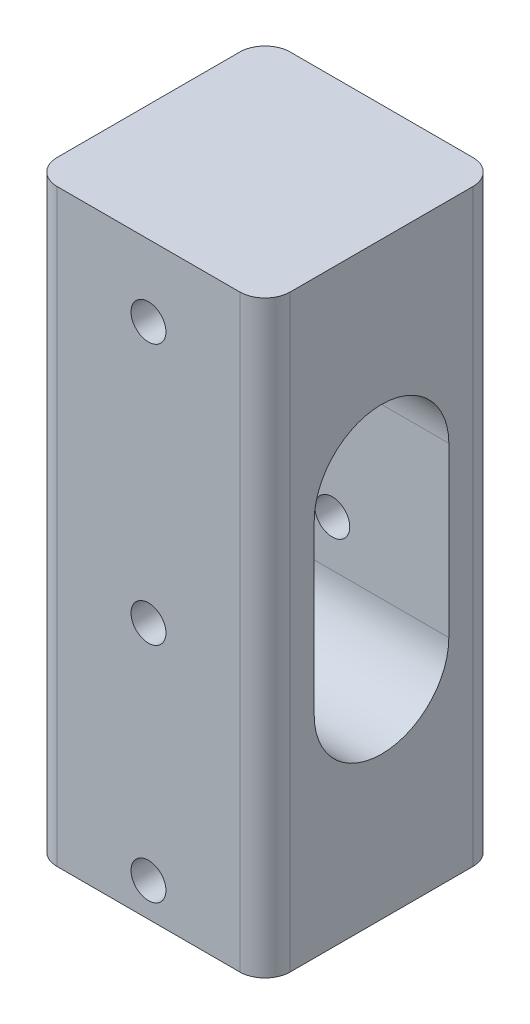
ISO-10303-21;
HEADER;
FILE_DESCRIPTION(('STEP AP214'),'2;1');
FILE_NAME('part.step','',(''),(''),'','','');
FILE_SCHEMA(('AUTOMOTIVE_DESIGN { 1 0 10303 214 1 1 1 1 }'));
ENDSEC;
DATA;
#1=APPLICATION_CONTEXT('core data for automotive mechanical design processes');
#2=APPLICATION_PROTOCOL_DEFINITION('international standard','automotive_design',2000,#1);
#3=PRODUCT_CONTEXT('',#1,'mechanical');
#4=PRODUCT('Part','Part','',(#3));
#5=PRODUCT_RELATED_PRODUCT_CATEGORY('part','',(#4));
#6=PRODUCT_DEFINITION_FORMATION('','',#4);
#7=PRODUCT_DEFINITION_CONTEXT('part definition',#1,'design');
#8=PRODUCT_DEFINITION('design','',#6,#7);
#9=PRODUCT_DEFINITION_SHAPE('','',#8);
#10=(LENGTH_UNIT() NAMED_UNIT(*) SI_UNIT(.MILLI.,.METRE.));
#11=(NAMED_UNIT(*) PLANE_ANGLE_UNIT() SI_UNIT($,.RADIAN.));
#12=(NAMED_UNIT(*) SI_UNIT($,.STERADIAN.) SOLID_ANGLE_UNIT());
#13=UNCERTAINTY_MEASURE_WITH_UNIT(LENGTH_MEASURE(1.E-05),#10,'distance_accuracy_value','');
#14=(GEOMETRIC_REPRESENTATION_CONTEXT(3) GLOBAL_UNCERTAINTY_ASSIGNED_CONTEXT((#13)) GLOBAL_UNIT_ASSIGNED_CONTEXT((#10,
#11,#12)) REPRESENTATION_CONTEXT('',''));
#15=CARTESIAN_POINT('',(0.,0.,0.));
#16=DIRECTION('',(0.,0.,1.));
#17=DIRECTION('',(1.,0.,0.));
#18=AXIS2_PLACEMENT_3D('',#15,#16,#17);
#19=CARTESIAN_POINT('',(0.,30.5,-56.15));
#20=DIRECTION('',(0.,0.,1.));
#21=DIRECTION('',(1.,0.,0.));
#22=AXIS2_PLACEMENT_3D('',#19,#20,#21);
#23=CYLINDRICAL_SURFACE('',#22,2.075);
#24=CARTESIAN_POINT('',(0.,30.5,-8.));
#25=DIRECTION('',(0.,0.,-1.));
#26=DIRECTION('',(-1.,0.,0.));
#27=AXIS2_PLACEMENT_3D('',#24,#25,#26);
#28=CIRCLE('',#27,2.075);
#29=CARTESIAN_POINT('',(-2.075,30.5,-8.));
#30=VERTEX_POINT('',#29);
#31=EDGE_CURVE('E162',#30,#30,#28,.F.);
#32=ORIENTED_EDGE('',*,*,#31,.T.);
#33=EDGE_LOOP('',(#32));
#34=FACE_BOUND('',#33,.T.);
#35=CARTESIAN_POINT('',(0.,30.5,-13.85));
#36=DIRECTION('',(0.,0.,1.));
#37=DIRECTION('',(1.,0.,0.));
#38=AXIS2_PLACEMENT_3D('',#35,#36,#37);
#39=CIRCLE('',#38,2.075);
#40=CARTESIAN_POINT('',(2.075,30.5,-13.85));
#41=VERTEX_POINT('',#40);
#42=EDGE_CURVE('E182',#41,#41,#39,.T.);
#43=ORIENTED_EDGE('',*,*,#42,.F.);
#44=EDGE_LOOP('',(#43));
#45=FACE_BOUND('',#44,.T.);
#46=ADVANCED_FACE('F35',(#34,#45),#23,.F.);
#47=CARTESIAN_POINT('',(13.85,70.,13.85));
#48=DIRECTION('',(-1.,0.,0.));
#49=DIRECTION('',(0.,0.,1.));
#50=AXIS2_PLACEMENT_3D('',#47,#48,#49);
#51=PLANE('',#50);
#52=DIRECTION('',(0.,-1.,0.));
#53=VECTOR('',#52,1.);
#54=CARTESIAN_POINT('',(13.85,70.,-8.));
#55=LINE('',#54,#53);
#56=CARTESIAN_POINT('',(13.85,45.,-8.));
#57=VERTEX_POINT('',#56);
#58=CARTESIAN_POINT('',(13.85,25.,-8.));
#59=VERTEX_POINT('',#58);
#60=EDGE_CURVE('E163',#57,#59,#55,.T.);
#61=ORIENTED_EDGE('',*,*,#60,.T.);
#62=CARTESIAN_POINT('',(13.85,25.,0.));
#63=DIRECTION('',(-1.,0.,0.));
#64=DIRECTION('',(0.,0.,1.));
#65=AXIS2_PLACEMENT_3D('',#62,#63,#64);
#66=CIRCLE('',#65,8.);
#67=CARTESIAN_POINT('',(13.85,25.,8.));
#68=VERTEX_POINT('',#67);
#69=EDGE_CURVE('E167',#59,#68,#66,.T.);
#70=ORIENTED_EDGE('',*,*,#69,.T.);
#71=DIRECTION('',(0.,1.,0.));
#72=VECTOR('',#71,1.);
#73=CARTESIAN_POINT('',(13.85,70.,8.));
#74=LINE('',#73,#72);
#75=CARTESIAN_POINT('',(13.85,45.,8.));
#76=VERTEX_POINT('',#75);
#77=EDGE_CURVE('E160',#68,#76,#74,.T.);
#78=ORIENTED_EDGE('',*,*,#77,.T.);
#79=CARTESIAN_POINT('',(13.85,45.,0.));
#80=DIRECTION('',(-1.,0.,0.));
#81=DIRECTION('',(0.,0.,1.));
#82=AXIS2_PLACEMENT_3D('',#79,#80,#81);
#83=CIRCLE('',#82,8.);
#84=EDGE_CURVE('E133',#76,#57,#83,.T.);
#85=ORIENTED_EDGE('',*,*,#84,.T.);
#86=EDGE_LOOP('',(#61,#70,#78,#85));
#87=FACE_BOUND('',#86,.T.);
#88=DIRECTION('',(0.,0.,-1.));
#89=VECTOR('',#88,1.);
#90=CARTESIAN_POINT('',(13.85,70.,13.85));
#91=LINE('',#90,#89);
#92=CARTESIAN_POINT('',(13.85,70.,10.85));
#93=VERTEX_POINT('',#92);
#94=CARTESIAN_POINT('',(13.85,70.,-10.85));
#95=VERTEX_POINT('',#94);
#96=EDGE_CURVE('E189',#93,#95,#91,.T.);
#97=ORIENTED_EDGE('',*,*,#96,.F.);
#98=DIRECTION('',(0.,-1.,0.));
#99=VECTOR('',#98,1.);
#100=CARTESIAN_POINT('',(13.85,70.,10.85));
#101=LINE('',#100,#99);
#102=CARTESIAN_POINT('',(13.85,0.,10.85));
#103=VERTEX_POINT('',#102);
#104=EDGE_CURVE('E215',#93,#103,#101,.T.);
#105=ORIENTED_EDGE('',*,*,#104,.T.);
#106=DIRECTION('',(0.,0.,-1.));
#107=VECTOR('',#106,1.);
#108=CARTESIAN_POINT('',(13.85,0.,13.85));
#109=LINE('',#108,#107);
#110=CARTESIAN_POINT('',(13.85,0.,-10.85));
#111=VERTEX_POINT('',#110);
#112=EDGE_CURVE('E188',#103,#111,#109,.T.);
#113=ORIENTED_EDGE('',*,*,#112,.T.);
#114=DIRECTION('',(0.,-1.,0.));
#115=VECTOR('',#114,1.);
#116=CARTESIAN_POINT('',(13.85,70.,-10.85));
#117=LINE('',#116,#115);
#118=EDGE_CURVE('E200',#111,#95,#117,.F.);
#119=ORIENTED_EDGE('',*,*,#118,.T.);
#120=EDGE_LOOP('',(#97,#105,#113,#119));
#121=FACE_BOUND('',#120,.T.);
#122=ADVANCED_FACE('F272',(#87,#121),#51,.F.);
#123=CARTESIAN_POINT('',(-13.85,70.,-13.85));
#124=DIRECTION('',(0.,0.,1.));
#125=DIRECTION('',(1.,0.,0.));
#126=AXIS2_PLACEMENT_3D('',#123,#124,#125);
#127=PLANE('',#126);
#128=CARTESIAN_POINT('',(0.,4.,-13.85));
#129=DIRECTION('',(0.,0.,1.));
#130=DIRECTION('',(1.,0.,0.));
#131=AXIS2_PLACEMENT_3D('',#128,#129,#130);
#132=CIRCLE('',#131,2.075);
#133=CARTESIAN_POINT('',(2.075,4.,-13.85));
#134=VERTEX_POINT('',#133);
#135=EDGE_CURVE('E185',#134,#134,#132,.T.);
#136=ORIENTED_EDGE('',*,*,#135,.T.);
#137=EDGE_LOOP('',(#136));
#138=FACE_BOUND('',#137,.T.);
#139=ORIENTED_EDGE('',*,*,#42,.T.);
#140=EDGE_LOOP('',(#139));
#141=FACE_BOUND('',#140,.T.);
#142=CARTESIAN_POINT('',(0.,61.5,-13.85));
#143=DIRECTION('',(0.,0.,1.));
#144=DIRECTION('',(1.,0.,0.));
#145=AXIS2_PLACEMENT_3D('',#142,#143,#144);
#146=CIRCLE('',#145,2.075);
#147=CARTESIAN_POINT('',(2.075,61.5,-13.85));
#148=VERTEX_POINT('',#147);
#149=EDGE_CURVE('E174',#148,#148,#146,.T.);
#150=ORIENTED_EDGE('',*,*,#149,.T.);
#151=EDGE_LOOP('',(#150));
#152=FACE_BOUND('',#151,.T.);
#153=DIRECTION('',(-1.,0.,0.));
#154=VECTOR('',#153,1.);
#155=CARTESIAN_POINT('',(-13.85,0.,-13.85));
#156=LINE('',#155,#154);
#157=CARTESIAN_POINT('',(10.85,0.,-13.85));
#158=VERTEX_POINT('',#157);
#159=CARTESIAN_POINT('',(-10.85,0.,-13.85));
#160=VERTEX_POINT('',#159);
#161=EDGE_CURVE('E203',#158,#160,#156,.T.);
#162=ORIENTED_EDGE('',*,*,#161,.T.);
#163=DIRECTION('',(0.,-1.,0.));
#164=VECTOR('',#163,1.);
#165=CARTESIAN_POINT('',(-10.85,70.,-13.85));
#166=LINE('',#165,#164);
#167=CARTESIAN_POINT('',(-10.85,70.,-13.85));
#168=VERTEX_POINT('',#167);
#169=EDGE_CURVE('E11',#160,#168,#166,.F.);
#170=ORIENTED_EDGE('',*,*,#169,.T.);
#171=DIRECTION('',(-1.,0.,0.));
#172=VECTOR('',#171,1.);
#173=CARTESIAN_POINT('',(-13.85,70.,-13.85));
#174=LINE('',#173,#172);
#175=CARTESIAN_POINT('',(10.85,70.,-13.85));
#176=VERTEX_POINT('',#175);
#177=EDGE_CURVE('E192',#176,#168,#174,.T.);
#178=ORIENTED_EDGE('',*,*,#177,.F.);
#179=DIRECTION('',(0.,-1.,0.));
#180=VECTOR('',#179,1.);
#181=CARTESIAN_POINT('',(10.85,70.,-13.85));
#182=LINE('',#181,#180);
#183=EDGE_CURVE('E43',#176,#158,#182,.T.);
#184=ORIENTED_EDGE('',*,*,#183,.T.);
#185=EDGE_LOOP('',(#162,#170,#178,#184));
#186=FACE_BOUND('',#185,.T.);
#187=ADVANCED_FACE('F246',(#138,#141,#152,#186),#127,.F.);
#188=CARTESIAN_POINT('',(-13.85,70.,13.85));
#189=DIRECTION('',(1.,0.,0.));
#190=DIRECTION('',(0.,0.,-1.));
#191=AXIS2_PLACEMENT_3D('',#188,#189,#190);
#192=PLANE('',#191);
#193=DIRECTION('',(0.,1.,0.));
#194=VECTOR('',#193,1.);
#195=CARTESIAN_POINT('',(-13.85,25.,8.));
#196=LINE('',#195,#194);
#197=CARTESIAN_POINT('',(-13.85,25.,8.));
#198=VERTEX_POINT('',#197);
#199=CARTESIAN_POINT('',(-13.85,45.,8.));
#200=VERTEX_POINT('',#199);
#201=EDGE_CURVE('E141',#198,#200,#196,.T.);
#202=ORIENTED_EDGE('',*,*,#201,.F.);
#203=CARTESIAN_POINT('',(-13.85,25.,0.));
#204=DIRECTION('',(-1.,0.,0.));
#205=DIRECTION('',(0.,0.,1.));
#206=AXIS2_PLACEMENT_3D('',#203,#204,#205);
#207=CIRCLE('',#206,8.);
#208=CARTESIAN_POINT('',(-13.85,25.,-8.));
#209=VERTEX_POINT('',#208);
#210=EDGE_CURVE('E146',#209,#198,#207,.T.);
#211=ORIENTED_EDGE('',*,*,#210,.F.);
#212=DIRECTION('',(0.,-1.,0.));
#213=VECTOR('',#212,1.);
#214=CARTESIAN_POINT('',(-13.85,25.,-8.));
#215=LINE('',#214,#213);
#216=CARTESIAN_POINT('',(-13.85,45.,-8.));
#217=VERTEX_POINT('',#216);
#218=EDGE_CURVE('E150',#217,#209,#215,.T.);
#219=ORIENTED_EDGE('',*,*,#218,.F.);
#220=CARTESIAN_POINT('',(-13.85,45.,0.));
#221=DIRECTION('',(-1.,0.,0.));
#222=DIRECTION('',(0.,0.,1.));
#223=AXIS2_PLACEMENT_3D('',#220,#221,#222);
#224=CIRCLE('',#223,8.);
#225=EDGE_CURVE('E130',#200,#217,#224,.T.);
#226=ORIENTED_EDGE('',*,*,#225,.F.);
#227=EDGE_LOOP('',(#202,#211,#219,#226));
#228=FACE_BOUND('',#227,.T.);
#229=DIRECTION('',(0.,0.,1.));
#230=VECTOR('',#229,1.);
#231=CARTESIAN_POINT('',(-13.85,70.,13.85));
#232=LINE('',#231,#230);
#233=CARTESIAN_POINT('',(-13.85,70.,-10.85));
#234=VERTEX_POINT('',#233);
#235=CARTESIAN_POINT('',(-13.85,70.,10.85));
#236=VERTEX_POINT('',#235);
#237=EDGE_CURVE('E195',#234,#236,#232,.T.);
#238=ORIENTED_EDGE('',*,*,#237,.F.);
#239=DIRECTION('',(0.,-1.,0.));
#240=VECTOR('',#239,1.);
#241=CARTESIAN_POINT('',(-13.85,70.,-10.85));
#242=LINE('',#241,#240);
#243=CARTESIAN_POINT('',(-13.85,0.,-10.85));
#244=VERTEX_POINT('',#243);
#245=EDGE_CURVE('E239',#234,#244,#242,.T.);
#246=ORIENTED_EDGE('',*,*,#245,.T.);
#247=DIRECTION('',(0.,0.,1.));
#248=VECTOR('',#247,1.);
#249=CARTESIAN_POINT('',(-13.85,0.,13.85));
#250=LINE('',#249,#248);
#251=CARTESIAN_POINT('',(-13.85,0.,10.85));
#252=VERTEX_POINT('',#251);
#253=EDGE_CURVE('E206',#244,#252,#250,.T.);
#254=ORIENTED_EDGE('',*,*,#253,.T.);
#255=DIRECTION('',(0.,-1.,0.));
#256=VECTOR('',#255,1.);
#257=CARTESIAN_POINT('',(-13.85,70.,10.85));
#258=LINE('',#257,#256);
#259=EDGE_CURVE('E50',#252,#236,#258,.F.);
#260=ORIENTED_EDGE('',*,*,#259,.T.);
#261=EDGE_LOOP('',(#238,#246,#254,#260));
#262=FACE_BOUND('',#261,.T.);
#263=ADVANCED_FACE('F148',(#228,#262),#192,.F.);
#264=CARTESIAN_POINT('',(-13.85,70.,13.85));
#265=DIRECTION('',(0.,0.,-1.));
#266=DIRECTION('',(-1.,0.,0.));
#267=AXIS2_PLACEMENT_3D('',#264,#265,#266);
#268=PLANE('',#267);
#269=CARTESIAN_POINT('',(0.,4.,13.85));
#270=DIRECTION('',(0.,0.,1.));
#271=DIRECTION('',(1.,0.,0.));
#272=AXIS2_PLACEMENT_3D('',#269,#270,#271);
#273=CIRCLE('',#272,2.075);
#274=CARTESIAN_POINT('',(2.075,4.,13.85));
#275=VERTEX_POINT('',#274);
#276=EDGE_CURVE('E171',#275,#275,#273,.T.);
#277=ORIENTED_EDGE('',*,*,#276,.F.);
#278=EDGE_LOOP('',(#277));
#279=FACE_BOUND('',#278,.T.);
#280=CARTESIAN_POINT('',(0.,30.5,13.85));
#281=DIRECTION('',(0.,0.,1.));
#282=DIRECTION('',(1.,0.,0.));
#283=AXIS2_PLACEMENT_3D('',#280,#281,#282);
#284=CIRCLE('',#283,2.075);
#285=CARTESIAN_POINT('',(2.075,30.5,13.85));
#286=VERTEX_POINT('',#285);
#287=EDGE_CURVE('E175',#286,#286,#284,.T.);
#288=ORIENTED_EDGE('',*,*,#287,.F.);
#289=EDGE_LOOP('',(#288));
#290=FACE_BOUND('',#289,.T.);
#291=CARTESIAN_POINT('',(0.,61.5,13.85));
#292=DIRECTION('',(0.,0.,1.));
#293=DIRECTION('',(1.,0.,0.));
#294=AXIS2_PLACEMENT_3D('',#291,#292,#293);
#295=CIRCLE('',#294,2.075);
#296=CARTESIAN_POINT('',(2.075,61.5,13.85));
#297=VERTEX_POINT('',#296);
#298=EDGE_CURVE('E170',#297,#297,#295,.T.);
#299=ORIENTED_EDGE('',*,*,#298,.F.);
#300=EDGE_LOOP('',(#299));
#301=FACE_BOUND('',#300,.T.);
#302=DIRECTION('',(1.,0.,0.));
#303=VECTOR('',#302,1.);
#304=CARTESIAN_POINT('',(-13.85,0.,13.85));
#305=LINE('',#304,#303);
#306=CARTESIAN_POINT('',(-10.85,0.,13.85));
#307=VERTEX_POINT('',#306);
#308=CARTESIAN_POINT('',(10.85,0.,13.85));
#309=VERTEX_POINT('',#308);
#310=EDGE_CURVE('E193',#307,#309,#305,.T.);
#311=ORIENTED_EDGE('',*,*,#310,.T.);
#312=DIRECTION('',(0.,-1.,0.));
#313=VECTOR('',#312,1.);
#314=CARTESIAN_POINT('',(10.85,70.,13.85));
#315=LINE('',#314,#313);
#316=CARTESIAN_POINT('',(10.85,70.,13.85));
#317=VERTEX_POINT('',#316);
#318=EDGE_CURVE('E229',#309,#317,#315,.F.);
#319=ORIENTED_EDGE('',*,*,#318,.T.);
#320=DIRECTION('',(1.,0.,0.));
#321=VECTOR('',#320,1.);
#322=CARTESIAN_POINT('',(-13.85,70.,13.85));
#323=LINE('',#322,#321);
#324=CARTESIAN_POINT('',(-10.85,70.,13.85));
#325=VERTEX_POINT('',#324);
#326=EDGE_CURVE('E197',#325,#317,#323,.T.);
#327=ORIENTED_EDGE('',*,*,#326,.F.);
#328=DIRECTION('',(0.,-1.,0.));
#329=VECTOR('',#328,1.);
#330=CARTESIAN_POINT('',(-10.85,70.,13.85));
#331=LINE('',#330,#329);
#332=EDGE_CURVE('E226',#325,#307,#331,.T.);
#333=ORIENTED_EDGE('',*,*,#332,.T.);
#334=EDGE_LOOP('',(#311,#319,#327,#333));
#335=FACE_BOUND('',#334,.T.);
#336=ADVANCED_FACE('F264',(#279,#290,#301,#335),#268,.F.);
#337=CARTESIAN_POINT('',(0.,70.,0.));
#338=DIRECTION('',(0.,-1.,0.));
#339=DIRECTION('',(0.,0.,-1.));
#340=AXIS2_PLACEMENT_3D('',#337,#338,#339);
#341=PLANE('',#340);
#342=ORIENTED_EDGE('',*,*,#326,.T.);
#343=CARTESIAN_POINT('',(10.85,70.,10.85));
#344=DIRECTION('',(0.,-1.,0.));
#345=DIRECTION('',(0.,0.,-1.));
#346=AXIS2_PLACEMENT_3D('',#343,#344,#345);
#347=CIRCLE('',#346,3.);
#348=EDGE_CURVE('E236',#317,#93,#347,.F.);
#349=ORIENTED_EDGE('',*,*,#348,.T.);
#350=ORIENTED_EDGE('',*,*,#96,.T.);
#351=CARTESIAN_POINT('',(10.85,70.,-10.85));
#352=DIRECTION('',(0.,-1.,0.));
#353=DIRECTION('',(0.,0.,-1.));
#354=AXIS2_PLACEMENT_3D('',#351,#352,#353);
#355=CIRCLE('',#354,3.);
#356=EDGE_CURVE('E233',#95,#176,#355,.F.);
#357=ORIENTED_EDGE('',*,*,#356,.T.);
#358=ORIENTED_EDGE('',*,*,#177,.T.);
#359=CARTESIAN_POINT('',(-10.85,70.,-10.85));
#360=DIRECTION('',(0.,-1.,0.));
#361=DIRECTION('',(0.,0.,-1.));
#362=AXIS2_PLACEMENT_3D('',#359,#360,#361);
#363=CIRCLE('',#362,3.);
#364=EDGE_CURVE('E57',#168,#234,#363,.F.);
#365=ORIENTED_EDGE('',*,*,#364,.T.);
#366=ORIENTED_EDGE('',*,*,#237,.T.);
#367=CARTESIAN_POINT('',(-10.85,70.,10.85));
#368=DIRECTION('',(0.,-1.,0.));
#369=DIRECTION('',(0.,0.,-1.));
#370=AXIS2_PLACEMENT_3D('',#367,#368,#369);
#371=CIRCLE('',#370,3.);
#372=EDGE_CURVE('E231',#236,#325,#371,.F.);
#373=ORIENTED_EDGE('',*,*,#372,.T.);
#374=EDGE_LOOP('',(#342,#349,#350,#357,#358,#365,#366,#373));
#375=FACE_BOUND('',#374,.T.);
#376=ADVANCED_FACE('F258',(#375),#341,.F.);
#377=CARTESIAN_POINT('',(0.,0.,0.));
#378=DIRECTION('',(0.,-1.,0.));
#379=DIRECTION('',(0.,0.,-1.));
#380=AXIS2_PLACEMENT_3D('',#377,#378,#379);
#381=PLANE('',#380);
#382=ORIENTED_EDGE('',*,*,#112,.F.);
#383=CARTESIAN_POINT('',(10.85,0.,10.85));
#384=DIRECTION('',(0.,-1.,0.));
#385=DIRECTION('',(0.,0.,-1.));
#386=AXIS2_PLACEMENT_3D('',#383,#384,#385);
#387=CIRCLE('',#386,3.);
#388=EDGE_CURVE('E224',#103,#309,#387,.T.);
#389=ORIENTED_EDGE('',*,*,#388,.T.);
#390=ORIENTED_EDGE('',*,*,#310,.F.);
#391=CARTESIAN_POINT('',(-10.85,0.,10.85));
#392=DIRECTION('',(0.,-1.,0.));
#393=DIRECTION('',(0.,0.,-1.));
#394=AXIS2_PLACEMENT_3D('',#391,#392,#393);
#395=CIRCLE('',#394,3.);
#396=EDGE_CURVE('E218',#307,#252,#395,.T.);
#397=ORIENTED_EDGE('',*,*,#396,.T.);
#398=ORIENTED_EDGE('',*,*,#253,.F.);
#399=CARTESIAN_POINT('',(-10.85,0.,-10.85));
#400=DIRECTION('',(0.,-1.,0.));
#401=DIRECTION('',(0.,0.,-1.));
#402=AXIS2_PLACEMENT_3D('',#399,#400,#401);
#403=CIRCLE('',#402,3.);
#404=EDGE_CURVE('E222',#244,#160,#403,.T.);
#405=ORIENTED_EDGE('',*,*,#404,.T.);
#406=ORIENTED_EDGE('',*,*,#161,.F.);
#407=CARTESIAN_POINT('',(10.85,0.,-10.85));
#408=DIRECTION('',(0.,-1.,0.));
#409=DIRECTION('',(0.,0.,-1.));
#410=AXIS2_PLACEMENT_3D('',#407,#408,#409);
#411=CIRCLE('',#410,3.);
#412=EDGE_CURVE('E220',#158,#111,#411,.T.);
#413=ORIENTED_EDGE('',*,*,#412,.T.);
#414=EDGE_LOOP('',(#382,#389,#390,#397,#398,#405,#406,#413));
#415=FACE_BOUND('',#414,.T.);
#416=ADVANCED_FACE('F252',(#415),#381,.T.);
#417=CARTESIAN_POINT('',(0.,61.5,-56.15));
#418=DIRECTION('',(0.,0.,1.));
#419=DIRECTION('',(1.,0.,0.));
#420=AXIS2_PLACEMENT_3D('',#417,#418,#419);
#421=CYLINDRICAL_SURFACE('',#420,2.075);
#422=ORIENTED_EDGE('',*,*,#298,.T.);
#423=EDGE_LOOP('',(#422));
#424=FACE_BOUND('',#423,.T.);
#425=ORIENTED_EDGE('',*,*,#149,.F.);
#426=EDGE_LOOP('',(#425));
#427=FACE_BOUND('',#426,.T.);
#428=ADVANCED_FACE('F295',(#424,#427),#421,.F.);
#429=CARTESIAN_POINT('',(0.,30.5,8.00000000000001));
#430=DIRECTION('',(0.,0.,1.));
#431=DIRECTION('',(1.,0.,0.));
#432=AXIS2_PLACEMENT_3D('',#429,#430,#431);
#433=CIRCLE('',#432,2.075);
#434=CARTESIAN_POINT('',(2.075,30.5,8.00000000000001));
#435=VERTEX_POINT('',#434);
#436=EDGE_CURVE('E157',#435,#435,#433,.F.);
#437=ORIENTED_EDGE('',*,*,#436,.T.);
#438=EDGE_LOOP('',(#437));
#439=FACE_BOUND('',#438,.T.);
#440=ORIENTED_EDGE('',*,*,#287,.T.);
#441=EDGE_LOOP('',(#440));
#442=FACE_BOUND('',#441,.T.);
#443=ADVANCED_FACE('F284',(#439,#442),#23,.F.);
#444=CARTESIAN_POINT('',(0.,4.,-56.15));
#445=DIRECTION('',(0.,0.,1.));
#446=DIRECTION('',(1.,0.,0.));
#447=AXIS2_PLACEMENT_3D('',#444,#445,#446);
#448=CYLINDRICAL_SURFACE('',#447,2.075);
#449=ORIENTED_EDGE('',*,*,#276,.T.);
#450=EDGE_LOOP('',(#449));
#451=FACE_BOUND('',#450,.T.);
#452=ORIENTED_EDGE('',*,*,#135,.F.);
#453=EDGE_LOOP('',(#452));
#454=FACE_BOUND('',#453,.T.);
#455=ADVANCED_FACE('F294',(#451,#454),#448,.F.);
#456=CARTESIAN_POINT('',(56.15,25.,0.));
#457=DIRECTION('',(-1.,0.,0.));
#458=DIRECTION('',(0.,0.,1.));
#459=AXIS2_PLACEMENT_3D('',#456,#457,#458);
#460=CYLINDRICAL_SURFACE('',#459,8.);
#461=DIRECTION('',(-1.,0.,0.));
#462=VECTOR('',#461,1.);
#463=CARTESIAN_POINT('',(56.15,25.,-8.));
#464=LINE('',#463,#462);
#465=EDGE_CURVE('E155',#59,#209,#464,.T.);
#466=ORIENTED_EDGE('',*,*,#465,.T.);
#467=ORIENTED_EDGE('',*,*,#210,.T.);
#468=DIRECTION('',(-1.,0.,0.));
#469=VECTOR('',#468,1.);
#470=CARTESIAN_POINT('',(56.15,25.,8.));
#471=LINE('',#470,#469);
#472=EDGE_CURVE('E137',#68,#198,#471,.T.);
#473=ORIENTED_EDGE('',*,*,#472,.F.);
#474=ORIENTED_EDGE('',*,*,#69,.F.);
#475=EDGE_LOOP('',(#466,#467,#473,#474));
#476=FACE_BOUND('',#475,.T.);
#477=ADVANCED_FACE('F301',(#476),#460,.F.);
#478=CARTESIAN_POINT('',(56.15,45.,0.));
#479=DIRECTION('',(-1.,0.,0.));
#480=DIRECTION('',(0.,0.,1.));
#481=AXIS2_PLACEMENT_3D('',#478,#479,#480);
#482=CYLINDRICAL_SURFACE('',#481,8.);
#483=DIRECTION('',(-1.,0.,0.));
#484=VECTOR('',#483,1.);
#485=CARTESIAN_POINT('',(56.15,45.,8.));
#486=LINE('',#485,#484);
#487=EDGE_CURVE('E125',#76,#200,#486,.T.);
#488=ORIENTED_EDGE('',*,*,#487,.T.);
#489=ORIENTED_EDGE('',*,*,#225,.T.);
#490=DIRECTION('',(-1.,0.,0.));
#491=VECTOR('',#490,1.);
#492=CARTESIAN_POINT('',(56.15,45.,-8.));
#493=LINE('',#492,#491);
#494=EDGE_CURVE('E136',#57,#217,#493,.T.);
#495=ORIENTED_EDGE('',*,*,#494,.F.);
#496=ORIENTED_EDGE('',*,*,#84,.F.);
#497=EDGE_LOOP('',(#488,#489,#495,#496));
#498=FACE_BOUND('',#497,.T.);
#499=ADVANCED_FACE('F127',(#498),#482,.F.);
#500=CARTESIAN_POINT('',(56.15,25.,-8.));
#501=DIRECTION('',(0.,0.,-1.));
#502=DIRECTION('',(-1.,0.,0.));
#503=AXIS2_PLACEMENT_3D('',#500,#501,#502);
#504=PLANE('',#503);
#505=ORIENTED_EDGE('',*,*,#31,.F.);
#506=EDGE_LOOP('',(#505));
#507=FACE_BOUND('',#506,.T.);
#508=ORIENTED_EDGE('',*,*,#494,.T.);
#509=ORIENTED_EDGE('',*,*,#218,.T.);
#510=ORIENTED_EDGE('',*,*,#465,.F.);
#511=ORIENTED_EDGE('',*,*,#60,.F.);
#512=EDGE_LOOP('',(#508,#509,#510,#511));
#513=FACE_BOUND('',#512,.T.);
#514=ADVANCED_FACE('F329',(#507,#513),#504,.F.);
#515=CARTESIAN_POINT('',(56.15,25.,8.));
#516=DIRECTION('',(0.,0.,1.));
#517=DIRECTION('',(1.,0.,0.));
#518=AXIS2_PLACEMENT_3D('',#515,#516,#517);
#519=PLANE('',#518);
#520=ORIENTED_EDGE('',*,*,#436,.F.);
#521=EDGE_LOOP('',(#520));
#522=FACE_BOUND('',#521,.T.);
#523=ORIENTED_EDGE('',*,*,#472,.T.);
#524=ORIENTED_EDGE('',*,*,#201,.T.);
#525=ORIENTED_EDGE('',*,*,#487,.F.);
#526=ORIENTED_EDGE('',*,*,#77,.F.);
#527=EDGE_LOOP('',(#523,#524,#525,#526));
#528=FACE_BOUND('',#527,.T.);
#529=ADVANCED_FACE('F142',(#522,#528),#519,.F.);
#530=CARTESIAN_POINT('',(10.85,70.,10.85));
#531=DIRECTION('',(0.,-1.,0.));
#532=DIRECTION('',(0.,0.,-1.));
#533=AXIS2_PLACEMENT_3D('',#530,#531,#532);
#534=CYLINDRICAL_SURFACE('',#533,3.);
#535=ORIENTED_EDGE('',*,*,#348,.F.);
#536=ORIENTED_EDGE('',*,*,#318,.F.);
#537=ORIENTED_EDGE('',*,*,#388,.F.);
#538=ORIENTED_EDGE('',*,*,#104,.F.);
#539=EDGE_LOOP('',(#535,#536,#537,#538));
#540=FACE_BOUND('',#539,.T.);
#541=ADVANCED_FACE('F269',(#540),#534,.T.);
#542=CARTESIAN_POINT('',(-10.85,70.,-10.85));
#543=DIRECTION('',(0.,-1.,0.));
#544=DIRECTION('',(0.,0.,-1.));
#545=AXIS2_PLACEMENT_3D('',#542,#543,#544);
#546=CYLINDRICAL_SURFACE('',#545,3.);
#547=ORIENTED_EDGE('',*,*,#364,.F.);
#548=ORIENTED_EDGE('',*,*,#169,.F.);
#549=ORIENTED_EDGE('',*,*,#404,.F.);
#550=ORIENTED_EDGE('',*,*,#245,.F.);
#551=EDGE_LOOP('',(#547,#548,#549,#550));
#552=FACE_BOUND('',#551,.T.);
#553=ADVANCED_FACE('F256',(#552),#546,.T.);
#554=CARTESIAN_POINT('',(10.85,70.,-10.85));
#555=DIRECTION('',(0.,-1.,0.));
#556=DIRECTION('',(0.,0.,-1.));
#557=AXIS2_PLACEMENT_3D('',#554,#555,#556);
#558=CYLINDRICAL_SURFACE('',#557,3.);
#559=ORIENTED_EDGE('',*,*,#356,.F.);
#560=ORIENTED_EDGE('',*,*,#118,.F.);
#561=ORIENTED_EDGE('',*,*,#412,.F.);
#562=ORIENTED_EDGE('',*,*,#183,.F.);
#563=EDGE_LOOP('',(#559,#560,#561,#562));
#564=FACE_BOUND('',#563,.T.);
#565=ADVANCED_FACE('F274',(#564),#558,.T.);
#566=CARTESIAN_POINT('',(-10.85,70.,10.85));
#567=DIRECTION('',(0.,-1.,0.));
#568=DIRECTION('',(0.,0.,-1.));
#569=AXIS2_PLACEMENT_3D('',#566,#567,#568);
#570=CYLINDRICAL_SURFACE('',#569,3.);
#571=ORIENTED_EDGE('',*,*,#372,.F.);
#572=ORIENTED_EDGE('',*,*,#259,.F.);
#573=ORIENTED_EDGE('',*,*,#396,.F.);
#574=ORIENTED_EDGE('',*,*,#332,.F.);
#575=EDGE_LOOP('',(#571,#572,#573,#574));
#576=FACE_BOUND('',#575,.T.);
#577=ADVANCED_FACE('F37',(#576),#570,.T.);
#578=CLOSED_SHELL('',(#46,#122,#187,#263,#336,#376,#416,#428,#443,#455,#477,#499,#514,#529,#541,
#553,#565,#577));
#579=MANIFOLD_SOLID_BREP('B2',#578);
#580=ADVANCED_BREP_SHAPE_REPRESENTATION('',(#18,#579),#14);
#581=SHAPE_DEFINITION_REPRESENTATION(#9,#580);
ENDSEC;
END-ISO-10303-21;
